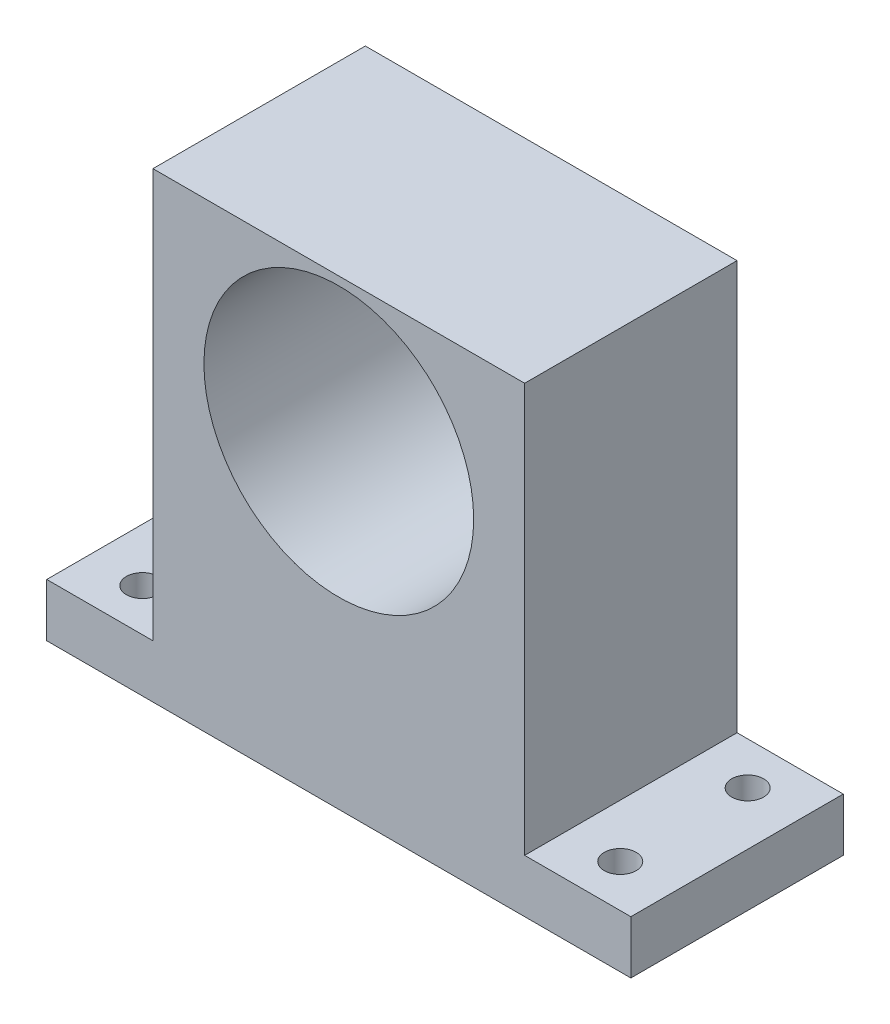
ISO-10303-21;
HEADER;
FILE_DESCRIPTION(('STEP AP214'),'2;1');
FILE_NAME('part.step','',(''),(''),'','','');
FILE_SCHEMA(('AUTOMOTIVE_DESIGN { 1 0 10303 214 1 1 1 1 }'));
ENDSEC;
DATA;
#1=APPLICATION_CONTEXT('core data for automotive mechanical design processes');
#2=APPLICATION_PROTOCOL_DEFINITION('international standard','automotive_design',2000,#1);
#3=PRODUCT_CONTEXT('',#1,'mechanical');
#4=PRODUCT('Part','Part','',(#3));
#5=PRODUCT_RELATED_PRODUCT_CATEGORY('part','',(#4));
#6=PRODUCT_DEFINITION_FORMATION('','',#4);
#7=PRODUCT_DEFINITION_CONTEXT('part definition',#1,'design');
#8=PRODUCT_DEFINITION('design','',#6,#7);
#9=PRODUCT_DEFINITION_SHAPE('','',#8);
#10=(LENGTH_UNIT() NAMED_UNIT(*) SI_UNIT(.MILLI.,.METRE.));
#11=(NAMED_UNIT(*) PLANE_ANGLE_UNIT() SI_UNIT($,.RADIAN.));
#12=(NAMED_UNIT(*) SI_UNIT($,.STERADIAN.) SOLID_ANGLE_UNIT());
#13=UNCERTAINTY_MEASURE_WITH_UNIT(LENGTH_MEASURE(1.E-05),#10,'distance_accuracy_value','');
#14=(GEOMETRIC_REPRESENTATION_CONTEXT(3) GLOBAL_UNCERTAINTY_ASSIGNED_CONTEXT((#13)) GLOBAL_UNIT_ASSIGNED_CONTEXT((#10,
#11,#12)) REPRESENTATION_CONTEXT('',''));
#15=CARTESIAN_POINT('',(0.,0.,0.));
#16=DIRECTION('',(0.,0.,1.));
#17=DIRECTION('',(1.,0.,0.));
#18=AXIS2_PLACEMENT_3D('',#15,#16,#17);
#19=CARTESIAN_POINT('',(-17.5,-21.75,20.));
#20=DIRECTION('',(1.,0.,0.));
#21=DIRECTION('',(0.,0.,-1.));
#22=AXIS2_PLACEMENT_3D('',#19,#20,#21);
#23=PLANE('',#22);
#24=DIRECTION('',(0.,0.,-1.));
#25=VECTOR('',#24,1.);
#26=CARTESIAN_POINT('',(-17.5,-16.75,0.));
#27=LINE('',#26,#25);
#28=CARTESIAN_POINT('',(-17.5,-16.75,20.));
#29=VERTEX_POINT('',#28);
#30=CARTESIAN_POINT('',(-17.5,-16.75,0.));
#31=VERTEX_POINT('',#30);
#32=EDGE_CURVE('E48',#29,#31,#27,.T.);
#33=ORIENTED_EDGE('',*,*,#32,.F.);
#34=DIRECTION('',(0.,-1.,0.));
#35=VECTOR('',#34,1.);
#36=CARTESIAN_POINT('',(-17.5,-21.75,20.));
#37=LINE('',#36,#35);
#38=CARTESIAN_POINT('',(-17.5,21.75,20.));
#39=VERTEX_POINT('',#38);
#40=EDGE_CURVE('E158',#39,#29,#37,.T.);
#41=ORIENTED_EDGE('',*,*,#40,.F.);
#42=DIRECTION('',(0.,0.,-1.));
#43=VECTOR('',#42,1.);
#44=CARTESIAN_POINT('',(-17.5,21.75,20.));
#45=LINE('',#44,#43);
#46=CARTESIAN_POINT('',(-17.5,21.75,0.));
#47=VERTEX_POINT('',#46);
#48=EDGE_CURVE('E41',#39,#47,#45,.T.);
#49=ORIENTED_EDGE('',*,*,#48,.T.);
#50=DIRECTION('',(0.,-1.,0.));
#51=VECTOR('',#50,1.);
#52=CARTESIAN_POINT('',(-17.5,-21.75,0.));
#53=LINE('',#52,#51);
#54=EDGE_CURVE('E111',#47,#31,#53,.T.);
#55=ORIENTED_EDGE('',*,*,#54,.T.);
#56=EDGE_LOOP('',(#33,#41,#49,#55));
#57=FACE_BOUND('',#56,.T.);
#58=ADVANCED_FACE('F33',(#57),#23,.F.);
#59=CARTESIAN_POINT('',(17.5,-21.75,20.));
#60=DIRECTION('',(-1.,0.,0.));
#61=DIRECTION('',(0.,0.,1.));
#62=AXIS2_PLACEMENT_3D('',#59,#60,#61);
#63=PLANE('',#62);
#64=DIRECTION('',(0.,0.,1.));
#65=VECTOR('',#64,1.);
#66=CARTESIAN_POINT('',(17.5,-16.75,20.));
#67=LINE('',#66,#65);
#68=CARTESIAN_POINT('',(17.5,-16.75,0.));
#69=VERTEX_POINT('',#68);
#70=CARTESIAN_POINT('',(17.5,-16.75,20.));
#71=VERTEX_POINT('',#70);
#72=EDGE_CURVE('E56',#69,#71,#67,.T.);
#73=ORIENTED_EDGE('',*,*,#72,.F.);
#74=DIRECTION('',(0.,1.,0.));
#75=VECTOR('',#74,1.);
#76=CARTESIAN_POINT('',(17.5,-21.75,0.));
#77=LINE('',#76,#75);
#78=CARTESIAN_POINT('',(17.5,21.75,0.));
#79=VERTEX_POINT('',#78);
#80=EDGE_CURVE('E154',#69,#79,#77,.T.);
#81=ORIENTED_EDGE('',*,*,#80,.T.);
#82=DIRECTION('',(0.,0.,-1.));
#83=VECTOR('',#82,1.);
#84=CARTESIAN_POINT('',(17.5,21.75,20.));
#85=LINE('',#84,#83);
#86=CARTESIAN_POINT('',(17.5,21.75,20.));
#87=VERTEX_POINT('',#86);
#88=EDGE_CURVE('E11',#87,#79,#85,.T.);
#89=ORIENTED_EDGE('',*,*,#88,.F.);
#90=DIRECTION('',(0.,1.,0.));
#91=VECTOR('',#90,1.);
#92=CARTESIAN_POINT('',(17.5,-21.75,20.));
#93=LINE('',#92,#91);
#94=EDGE_CURVE('E110',#71,#87,#93,.T.);
#95=ORIENTED_EDGE('',*,*,#94,.F.);
#96=EDGE_LOOP('',(#73,#81,#89,#95));
#97=FACE_BOUND('',#96,.T.);
#98=ADVANCED_FACE('F35',(#97),#63,.F.);
#99=CARTESIAN_POINT('',(-17.5,21.75,20.));
#100=DIRECTION('',(0.,-1.,0.));
#101=DIRECTION('',(0.,0.,-1.));
#102=AXIS2_PLACEMENT_3D('',#99,#100,#101);
#103=PLANE('',#102);
#104=DIRECTION('',(-1.,0.,0.));
#105=VECTOR('',#104,1.);
#106=CARTESIAN_POINT('',(-17.5,21.75,0.));
#107=LINE('',#106,#105);
#108=EDGE_CURVE('E162',#79,#47,#107,.T.);
#109=ORIENTED_EDGE('',*,*,#108,.T.);
#110=ORIENTED_EDGE('',*,*,#48,.F.);
#111=DIRECTION('',(-1.,0.,0.));
#112=VECTOR('',#111,1.);
#113=CARTESIAN_POINT('',(-17.5,21.75,20.));
#114=LINE('',#113,#112);
#115=EDGE_CURVE('E156',#87,#39,#114,.T.);
#116=ORIENTED_EDGE('',*,*,#115,.F.);
#117=ORIENTED_EDGE('',*,*,#88,.T.);
#118=EDGE_LOOP('',(#109,#110,#116,#117));
#119=FACE_BOUND('',#118,.T.);
#120=ADVANCED_FACE('F176',(#119),#103,.F.);
#121=CARTESIAN_POINT('',(-17.5,-21.75,20.));
#122=DIRECTION('',(0.,1.,0.));
#123=DIRECTION('',(0.,0.,1.));
#124=AXIS2_PLACEMENT_3D('',#121,#122,#123);
#125=PLANE('',#124);
#126=CARTESIAN_POINT('',(-22.5,-21.75,4.));
#127=DIRECTION('',(0.,1.,0.));
#128=DIRECTION('',(0.,0.,1.));
#129=AXIS2_PLACEMENT_3D('',#126,#127,#128);
#130=CIRCLE('',#129,1.5);
#131=CARTESIAN_POINT('',(-22.5,-21.75,5.5));
#132=VERTEX_POINT('',#131);
#133=EDGE_CURVE('E214',#132,#132,#130,.T.);
#134=ORIENTED_EDGE('',*,*,#133,.T.);
#135=EDGE_LOOP('',(#134));
#136=FACE_BOUND('',#135,.T.);
#137=CARTESIAN_POINT('',(22.5,-21.75,16.));
#138=DIRECTION('',(0.,1.,0.));
#139=DIRECTION('',(0.,0.,1.));
#140=AXIS2_PLACEMENT_3D('',#137,#138,#139);
#141=CIRCLE('',#140,1.5);
#142=CARTESIAN_POINT('',(22.5,-21.75,17.5));
#143=VERTEX_POINT('',#142);
#144=EDGE_CURVE('E218',#143,#143,#141,.T.);
#145=ORIENTED_EDGE('',*,*,#144,.T.);
#146=EDGE_LOOP('',(#145));
#147=FACE_BOUND('',#146,.T.);
#148=CARTESIAN_POINT('',(22.5,-21.75,4.));
#149=DIRECTION('',(0.,1.,0.));
#150=DIRECTION('',(0.,0.,1.));
#151=AXIS2_PLACEMENT_3D('',#148,#149,#150);
#152=CIRCLE('',#151,1.5);
#153=CARTESIAN_POINT('',(22.5,-21.75,5.5));
#154=VERTEX_POINT('',#153);
#155=EDGE_CURVE('E222',#154,#154,#152,.T.);
#156=ORIENTED_EDGE('',*,*,#155,.T.);
#157=EDGE_LOOP('',(#156));
#158=FACE_BOUND('',#157,.T.);
#159=CARTESIAN_POINT('',(-22.5,-21.75,16.));
#160=DIRECTION('',(0.,1.,0.));
#161=DIRECTION('',(0.,0.,1.));
#162=AXIS2_PLACEMENT_3D('',#159,#160,#161);
#163=CIRCLE('',#162,1.5);
#164=CARTESIAN_POINT('',(-22.5,-21.75,17.5));
#165=VERTEX_POINT('',#164);
#166=EDGE_CURVE('E126',#165,#165,#163,.T.);
#167=ORIENTED_EDGE('',*,*,#166,.T.);
#168=EDGE_LOOP('',(#167));
#169=FACE_BOUND('',#168,.T.);
#170=DIRECTION('',(1.,0.,0.));
#171=VECTOR('',#170,1.);
#172=CARTESIAN_POINT('',(-17.5,-21.75,0.));
#173=LINE('',#172,#171);
#174=CARTESIAN_POINT('',(-27.5,-21.75,0.));
#175=VERTEX_POINT('',#174);
#176=CARTESIAN_POINT('',(27.5,-21.75,0.));
#177=VERTEX_POINT('',#176);
#178=EDGE_CURVE('E99',#175,#177,#173,.T.);
#179=ORIENTED_EDGE('',*,*,#178,.T.);
#180=DIRECTION('',(0.,0.,-1.));
#181=VECTOR('',#180,1.);
#182=CARTESIAN_POINT('',(27.5,-21.75,20.));
#183=LINE('',#182,#181);
#184=CARTESIAN_POINT('',(27.5,-21.75,20.));
#185=VERTEX_POINT('',#184);
#186=EDGE_CURVE('E142',#185,#177,#183,.T.);
#187=ORIENTED_EDGE('',*,*,#186,.F.);
#188=DIRECTION('',(1.,0.,0.));
#189=VECTOR('',#188,1.);
#190=CARTESIAN_POINT('',(-17.5,-21.75,20.));
#191=LINE('',#190,#189);
#192=CARTESIAN_POINT('',(-27.5,-21.75,20.));
#193=VERTEX_POINT('',#192);
#194=EDGE_CURVE('E116',#193,#185,#191,.T.);
#195=ORIENTED_EDGE('',*,*,#194,.F.);
#196=DIRECTION('',(0.,0.,1.));
#197=VECTOR('',#196,1.);
#198=CARTESIAN_POINT('',(-27.5,-21.75,0.));
#199=LINE('',#198,#197);
#200=EDGE_CURVE('E114',#175,#193,#199,.T.);
#201=ORIENTED_EDGE('',*,*,#200,.F.);
#202=EDGE_LOOP('',(#179,#187,#195,#201));
#203=FACE_BOUND('',#202,.T.);
#204=ADVANCED_FACE('F115',(#136,#147,#158,#169,#203),#125,.F.);
#205=CARTESIAN_POINT('',(0.,0.,20.));
#206=DIRECTION('',(0.,0.,-1.));
#207=DIRECTION('',(-1.,0.,0.));
#208=AXIS2_PLACEMENT_3D('',#205,#206,#207);
#209=PLANE('',#208);
#210=CARTESIAN_POINT('',(0.,8.25,20.));
#211=DIRECTION('',(0.,0.,-1.));
#212=DIRECTION('',(-1.,0.,0.));
#213=AXIS2_PLACEMENT_3D('',#210,#211,#212);
#214=CIRCLE('',#213,12.7);
#215=CARTESIAN_POINT('',(-12.7,8.25,20.));
#216=VERTEX_POINT('',#215);
#217=EDGE_CURVE('E239',#216,#216,#214,.T.);
#218=ORIENTED_EDGE('',*,*,#217,.T.);
#219=EDGE_LOOP('',(#218));
#220=FACE_BOUND('',#219,.T.);
#221=ORIENTED_EDGE('',*,*,#194,.T.);
#222=DIRECTION('',(0.,-1.,0.));
#223=VECTOR('',#222,1.);
#224=CARTESIAN_POINT('',(27.5,-21.75,20.));
#225=LINE('',#224,#223);
#226=CARTESIAN_POINT('',(27.5,-16.75,20.));
#227=VERTEX_POINT('',#226);
#228=EDGE_CURVE('E139',#227,#185,#225,.T.);
#229=ORIENTED_EDGE('',*,*,#228,.F.);
#230=DIRECTION('',(-1.,0.,0.));
#231=VECTOR('',#230,1.);
#232=CARTESIAN_POINT('',(27.5,-16.75,20.));
#233=LINE('',#232,#231);
#234=EDGE_CURVE('E147',#227,#71,#233,.T.);
#235=ORIENTED_EDGE('',*,*,#234,.T.);
#236=ORIENTED_EDGE('',*,*,#94,.T.);
#237=ORIENTED_EDGE('',*,*,#115,.T.);
#238=ORIENTED_EDGE('',*,*,#40,.T.);
#239=DIRECTION('',(1.,0.,0.));
#240=VECTOR('',#239,1.);
#241=CARTESIAN_POINT('',(-27.5,-16.75,20.));
#242=LINE('',#241,#240);
#243=CARTESIAN_POINT('',(-27.5,-16.75,20.));
#244=VERTEX_POINT('',#243);
#245=EDGE_CURVE('E136',#244,#29,#242,.T.);
#246=ORIENTED_EDGE('',*,*,#245,.F.);
#247=DIRECTION('',(0.,1.,0.));
#248=VECTOR('',#247,1.);
#249=CARTESIAN_POINT('',(-27.5,-21.75,20.));
#250=LINE('',#249,#248);
#251=EDGE_CURVE('E119',#193,#244,#250,.T.);
#252=ORIENTED_EDGE('',*,*,#251,.F.);
#253=EDGE_LOOP('',(#221,#229,#235,#236,#237,#238,#246,#252));
#254=FACE_BOUND('',#253,.T.);
#255=ADVANCED_FACE('F174',(#220,#254),#209,.F.);
#256=CARTESIAN_POINT('',(0.,0.,0.));
#257=DIRECTION('',(0.,0.,-1.));
#258=DIRECTION('',(-1.,0.,0.));
#259=AXIS2_PLACEMENT_3D('',#256,#257,#258);
#260=PLANE('',#259);
#261=CARTESIAN_POINT('',(0.,8.25,0.));
#262=DIRECTION('',(0.,0.,-1.));
#263=DIRECTION('',(-1.,0.,0.));
#264=AXIS2_PLACEMENT_3D('',#261,#262,#263);
#265=CIRCLE('',#264,12.7);
#266=CARTESIAN_POINT('',(-12.7,8.25,0.));
#267=VERTEX_POINT('',#266);
#268=EDGE_CURVE('E241',#267,#267,#265,.T.);
#269=ORIENTED_EDGE('',*,*,#268,.F.);
#270=EDGE_LOOP('',(#269));
#271=FACE_BOUND('',#270,.T.);
#272=ORIENTED_EDGE('',*,*,#80,.F.);
#273=DIRECTION('',(-1.,0.,0.));
#274=VECTOR('',#273,1.);
#275=CARTESIAN_POINT('',(27.5,-16.75,0.));
#276=LINE('',#275,#274);
#277=CARTESIAN_POINT('',(27.5,-16.75,0.));
#278=VERTEX_POINT('',#277);
#279=EDGE_CURVE('E151',#278,#69,#276,.T.);
#280=ORIENTED_EDGE('',*,*,#279,.F.);
#281=DIRECTION('',(0.,1.,0.));
#282=VECTOR('',#281,1.);
#283=CARTESIAN_POINT('',(27.5,-21.75,0.));
#284=LINE('',#283,#282);
#285=EDGE_CURVE('E106',#177,#278,#284,.T.);
#286=ORIENTED_EDGE('',*,*,#285,.F.);
#287=ORIENTED_EDGE('',*,*,#178,.F.);
#288=DIRECTION('',(0.,-1.,0.));
#289=VECTOR('',#288,1.);
#290=CARTESIAN_POINT('',(-27.5,-21.75,0.));
#291=LINE('',#290,#289);
#292=CARTESIAN_POINT('',(-27.5,-16.75,0.));
#293=VERTEX_POINT('',#292);
#294=EDGE_CURVE('E104',#293,#175,#291,.T.);
#295=ORIENTED_EDGE('',*,*,#294,.F.);
#296=DIRECTION('',(1.,0.,0.));
#297=VECTOR('',#296,1.);
#298=CARTESIAN_POINT('',(-27.5,-16.75,0.));
#299=LINE('',#298,#297);
#300=EDGE_CURVE('E133',#293,#31,#299,.T.);
#301=ORIENTED_EDGE('',*,*,#300,.T.);
#302=ORIENTED_EDGE('',*,*,#54,.F.);
#303=ORIENTED_EDGE('',*,*,#108,.F.);
#304=EDGE_LOOP('',(#272,#280,#286,#287,#295,#301,#302,#303));
#305=FACE_BOUND('',#304,.T.);
#306=ADVANCED_FACE('F101',(#271,#305),#260,.T.);
#307=CARTESIAN_POINT('',(27.5,-16.75,20.));
#308=DIRECTION('',(0.,-1.,0.));
#309=DIRECTION('',(0.,0.,-1.));
#310=AXIS2_PLACEMENT_3D('',#307,#308,#309);
#311=PLANE('',#310);
#312=CARTESIAN_POINT('',(22.5,-16.75,16.));
#313=DIRECTION('',(0.,1.,0.));
#314=DIRECTION('',(0.,0.,1.));
#315=AXIS2_PLACEMENT_3D('',#312,#313,#314);
#316=CIRCLE('',#315,1.5);
#317=CARTESIAN_POINT('',(22.5,-16.75,17.5));
#318=VERTEX_POINT('',#317);
#319=EDGE_CURVE('E228',#318,#318,#316,.T.);
#320=ORIENTED_EDGE('',*,*,#319,.F.);
#321=EDGE_LOOP('',(#320));
#322=FACE_BOUND('',#321,.T.);
#323=CARTESIAN_POINT('',(22.5,-16.75,4.));
#324=DIRECTION('',(0.,1.,0.));
#325=DIRECTION('',(0.,0.,1.));
#326=AXIS2_PLACEMENT_3D('',#323,#324,#325);
#327=CIRCLE('',#326,1.5);
#328=CARTESIAN_POINT('',(22.5,-16.75,5.5));
#329=VERTEX_POINT('',#328);
#330=EDGE_CURVE('E236',#329,#329,#327,.T.);
#331=ORIENTED_EDGE('',*,*,#330,.F.);
#332=EDGE_LOOP('',(#331));
#333=FACE_BOUND('',#332,.T.);
#334=ORIENTED_EDGE('',*,*,#72,.T.);
#335=ORIENTED_EDGE('',*,*,#234,.F.);
#336=DIRECTION('',(0.,0.,1.));
#337=VECTOR('',#336,1.);
#338=CARTESIAN_POINT('',(27.5,-16.75,20.));
#339=LINE('',#338,#337);
#340=EDGE_CURVE('E145',#278,#227,#339,.T.);
#341=ORIENTED_EDGE('',*,*,#340,.F.);
#342=ORIENTED_EDGE('',*,*,#279,.T.);
#343=EDGE_LOOP('',(#334,#335,#341,#342));
#344=FACE_BOUND('',#343,.T.);
#345=ADVANCED_FACE('F179',(#322,#333,#344),#311,.F.);
#346=CARTESIAN_POINT('',(27.5,0.,0.));
#347=DIRECTION('',(-1.,0.,0.));
#348=DIRECTION('',(0.,0.,1.));
#349=AXIS2_PLACEMENT_3D('',#346,#347,#348);
#350=PLANE('',#349);
#351=ORIENTED_EDGE('',*,*,#228,.T.);
#352=ORIENTED_EDGE('',*,*,#186,.T.);
#353=ORIENTED_EDGE('',*,*,#285,.T.);
#354=ORIENTED_EDGE('',*,*,#340,.T.);
#355=EDGE_LOOP('',(#351,#352,#353,#354));
#356=FACE_BOUND('',#355,.T.);
#357=ADVANCED_FACE('F183',(#356),#350,.F.);
#358=CARTESIAN_POINT('',(-27.5,-16.75,0.));
#359=DIRECTION('',(0.,-1.,0.));
#360=DIRECTION('',(0.,0.,-1.));
#361=AXIS2_PLACEMENT_3D('',#358,#359,#360);
#362=PLANE('',#361);
#363=CARTESIAN_POINT('',(-22.5,-16.75,4.));
#364=DIRECTION('',(0.,1.,0.));
#365=DIRECTION('',(0.,0.,1.));
#366=AXIS2_PLACEMENT_3D('',#363,#364,#365);
#367=CIRCLE('',#366,1.5);
#368=CARTESIAN_POINT('',(-22.5,-16.75,5.5));
#369=VERTEX_POINT('',#368);
#370=EDGE_CURVE('E232',#369,#369,#367,.T.);
#371=ORIENTED_EDGE('',*,*,#370,.F.);
#372=EDGE_LOOP('',(#371));
#373=FACE_BOUND('',#372,.T.);
#374=CARTESIAN_POINT('',(-22.5,-16.75,16.));
#375=DIRECTION('',(0.,1.,0.));
#376=DIRECTION('',(0.,0.,1.));
#377=AXIS2_PLACEMENT_3D('',#374,#375,#376);
#378=CIRCLE('',#377,1.5);
#379=CARTESIAN_POINT('',(-22.5,-16.75,17.5));
#380=VERTEX_POINT('',#379);
#381=EDGE_CURVE('E129',#380,#380,#378,.T.);
#382=ORIENTED_EDGE('',*,*,#381,.F.);
#383=EDGE_LOOP('',(#382));
#384=FACE_BOUND('',#383,.T.);
#385=ORIENTED_EDGE('',*,*,#32,.T.);
#386=ORIENTED_EDGE('',*,*,#300,.F.);
#387=DIRECTION('',(0.,0.,-1.));
#388=VECTOR('',#387,1.);
#389=CARTESIAN_POINT('',(-27.5,-16.75,0.));
#390=LINE('',#389,#388);
#391=EDGE_CURVE('E123',#244,#293,#390,.T.);
#392=ORIENTED_EDGE('',*,*,#391,.F.);
#393=ORIENTED_EDGE('',*,*,#245,.T.);
#394=EDGE_LOOP('',(#385,#386,#392,#393));
#395=FACE_BOUND('',#394,.T.);
#396=ADVANCED_FACE('F171',(#373,#384,#395),#362,.F.);
#397=CARTESIAN_POINT('',(-27.5,0.,0.));
#398=DIRECTION('',(1.,0.,0.));
#399=DIRECTION('',(0.,0.,-1.));
#400=AXIS2_PLACEMENT_3D('',#397,#398,#399);
#401=PLANE('',#400);
#402=ORIENTED_EDGE('',*,*,#294,.T.);
#403=ORIENTED_EDGE('',*,*,#200,.T.);
#404=ORIENTED_EDGE('',*,*,#251,.T.);
#405=ORIENTED_EDGE('',*,*,#391,.T.);
#406=EDGE_LOOP('',(#402,#403,#404,#405));
#407=FACE_BOUND('',#406,.T.);
#408=ADVANCED_FACE('F121',(#407),#401,.F.);
#409=CARTESIAN_POINT('',(-22.5,-21.75,16.));
#410=DIRECTION('',(0.,1.,0.));
#411=DIRECTION('',(0.,0.,1.));
#412=AXIS2_PLACEMENT_3D('',#409,#410,#411);
#413=CYLINDRICAL_SURFACE('',#412,1.5);
#414=ORIENTED_EDGE('',*,*,#166,.F.);
#415=EDGE_LOOP('',(#414));
#416=FACE_BOUND('',#415,.T.);
#417=ORIENTED_EDGE('',*,*,#381,.T.);
#418=EDGE_LOOP('',(#417));
#419=FACE_BOUND('',#418,.T.);
#420=ADVANCED_FACE('F282',(#416,#419),#413,.F.);
#421=CARTESIAN_POINT('',(-22.5,-21.75,4.));
#422=DIRECTION('',(0.,1.,0.));
#423=DIRECTION('',(0.,0.,1.));
#424=AXIS2_PLACEMENT_3D('',#421,#422,#423);
#425=CYLINDRICAL_SURFACE('',#424,1.5);
#426=ORIENTED_EDGE('',*,*,#133,.F.);
#427=EDGE_LOOP('',(#426));
#428=FACE_BOUND('',#427,.T.);
#429=ORIENTED_EDGE('',*,*,#370,.T.);
#430=EDGE_LOOP('',(#429));
#431=FACE_BOUND('',#430,.T.);
#432=ADVANCED_FACE('F287',(#428,#431),#425,.F.);
#433=CARTESIAN_POINT('',(22.5,-21.75,4.));
#434=DIRECTION('',(0.,1.,0.));
#435=DIRECTION('',(0.,0.,1.));
#436=AXIS2_PLACEMENT_3D('',#433,#434,#435);
#437=CYLINDRICAL_SURFACE('',#436,1.5);
#438=ORIENTED_EDGE('',*,*,#155,.F.);
#439=EDGE_LOOP('',(#438));
#440=FACE_BOUND('',#439,.T.);
#441=ORIENTED_EDGE('',*,*,#330,.T.);
#442=EDGE_LOOP('',(#441));
#443=FACE_BOUND('',#442,.T.);
#444=ADVANCED_FACE('F296',(#440,#443),#437,.F.);
#445=CARTESIAN_POINT('',(22.5,-21.75,16.));
#446=DIRECTION('',(0.,1.,0.));
#447=DIRECTION('',(0.,0.,1.));
#448=AXIS2_PLACEMENT_3D('',#445,#446,#447);
#449=CYLINDRICAL_SURFACE('',#448,1.5);
#450=ORIENTED_EDGE('',*,*,#144,.F.);
#451=EDGE_LOOP('',(#450));
#452=FACE_BOUND('',#451,.T.);
#453=ORIENTED_EDGE('',*,*,#319,.T.);
#454=EDGE_LOOP('',(#453));
#455=FACE_BOUND('',#454,.T.);
#456=ADVANCED_FACE('F250',(#452,#455),#449,.F.);
#457=CARTESIAN_POINT('',(0.,8.25,20.));
#458=DIRECTION('',(0.,0.,-1.));
#459=DIRECTION('',(-1.,0.,0.));
#460=AXIS2_PLACEMENT_3D('',#457,#458,#459);
#461=CYLINDRICAL_SURFACE('',#460,12.7);
#462=ORIENTED_EDGE('',*,*,#217,.F.);
#463=EDGE_LOOP('',(#462));
#464=FACE_BOUND('',#463,.T.);
#465=ORIENTED_EDGE('',*,*,#268,.T.);
#466=EDGE_LOOP('',(#465));
#467=FACE_BOUND('',#466,.T.);
#468=ADVANCED_FACE('F247',(#464,#467),#461,.F.);
#469=CLOSED_SHELL('',(#58,#98,#120,#204,#255,#306,#345,#357,#396,#408,#420,#432,#444,#456,#468));
#470=MANIFOLD_SOLID_BREP('B2',#469);
#471=ADVANCED_BREP_SHAPE_REPRESENTATION('',(#18,#470),#14);
#472=SHAPE_DEFINITION_REPRESENTATION(#9,#471);
ENDSEC;
END-ISO-10303-21;
